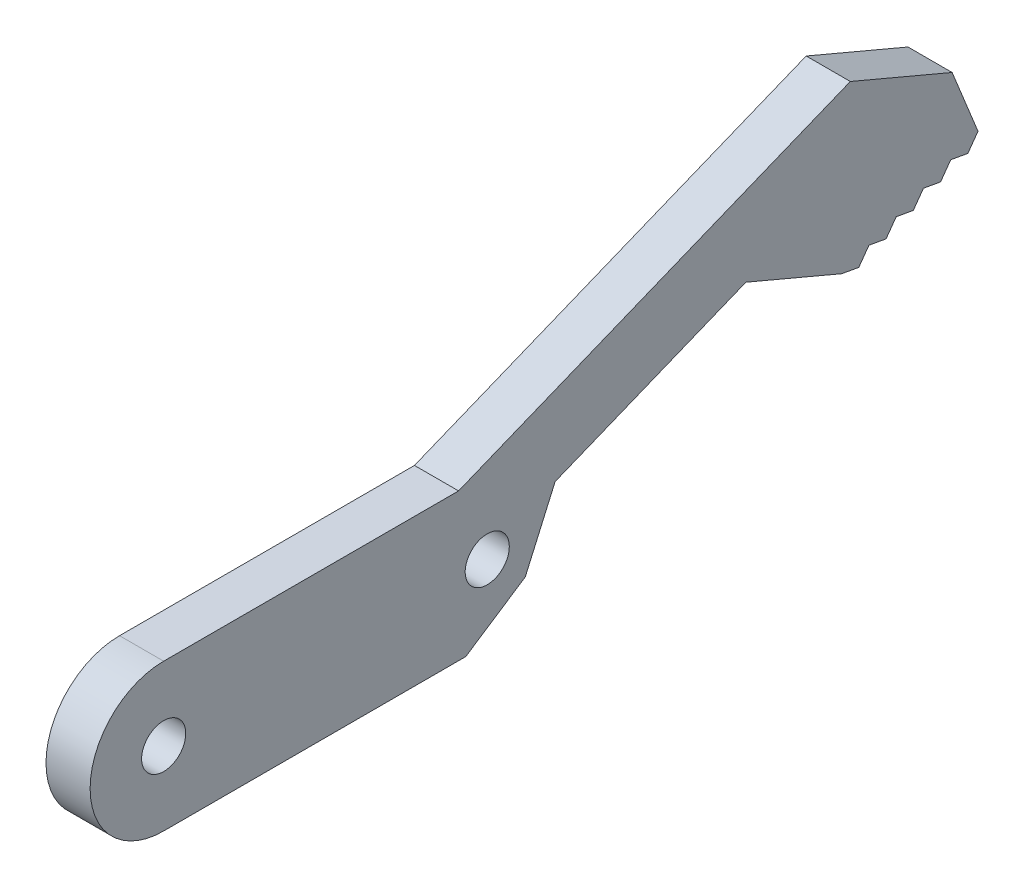
ISO-10303-21;
HEADER;
FILE_DESCRIPTION(('STEP AP214'),'2;1');
FILE_NAME('part.step','',(''),(''),'','','');
FILE_SCHEMA(('AUTOMOTIVE_DESIGN { 1 0 10303 214 1 1 1 1 }'));
ENDSEC;
DATA;
#1=APPLICATION_CONTEXT('core data for automotive mechanical design processes');
#2=APPLICATION_PROTOCOL_DEFINITION('international standard','automotive_design',2000,#1);
#3=PRODUCT_CONTEXT('',#1,'mechanical');
#4=PRODUCT('Part','Part','',(#3));
#5=PRODUCT_RELATED_PRODUCT_CATEGORY('part','',(#4));
#6=PRODUCT_DEFINITION_FORMATION('','',#4);
#7=PRODUCT_DEFINITION_CONTEXT('part definition',#1,'design');
#8=PRODUCT_DEFINITION('design','',#6,#7);
#9=PRODUCT_DEFINITION_SHAPE('','',#8);
#10=(LENGTH_UNIT() NAMED_UNIT(*) SI_UNIT(.MILLI.,.METRE.));
#11=(NAMED_UNIT(*) PLANE_ANGLE_UNIT() SI_UNIT($,.RADIAN.));
#12=(NAMED_UNIT(*) SI_UNIT($,.STERADIAN.) SOLID_ANGLE_UNIT());
#13=UNCERTAINTY_MEASURE_WITH_UNIT(LENGTH_MEASURE(1.E-05),#10,'distance_accuracy_value','');
#14=(GEOMETRIC_REPRESENTATION_CONTEXT(3) GLOBAL_UNCERTAINTY_ASSIGNED_CONTEXT((#13)) GLOBAL_UNIT_ASSIGNED_CONTEXT((#10,
#11,#12)) REPRESENTATION_CONTEXT('',''));
#15=CARTESIAN_POINT('',(0.,0.,0.));
#16=DIRECTION('',(0.,0.,1.));
#17=DIRECTION('',(1.,0.,0.));
#18=AXIS2_PLACEMENT_3D('',#15,#16,#17);
#19=CARTESIAN_POINT('',(3.,0.,0.));
#20=DIRECTION('',(1.,0.,0.));
#21=DIRECTION('',(0.,0.,-1.));
#22=AXIS2_PLACEMENT_3D('',#19,#20,#21);
#23=PLANE('',#22);
#24=CARTESIAN_POINT('',(3.,5.,-5.));
#25=DIRECTION('',(1.,0.,0.));
#26=DIRECTION('',(0.,0.,-1.));
#27=AXIS2_PLACEMENT_3D('',#24,#25,#26);
#28=CIRCLE('',#27,1.5);
#29=CARTESIAN_POINT('',(3.,5.,-6.5));
#30=VERTEX_POINT('',#29);
#31=EDGE_CURVE('E135',#30,#30,#28,.T.);
#32=ORIENTED_EDGE('',*,*,#31,.F.);
#33=EDGE_LOOP('',(#32));
#34=FACE_BOUND('',#33,.T.);
#35=CARTESIAN_POINT('',(3.,5.,-27.));
#36=DIRECTION('',(1.,0.,0.));
#37=DIRECTION('',(0.,0.,-1.));
#38=AXIS2_PLACEMENT_3D('',#35,#36,#37);
#39=CIRCLE('',#38,1.5);
#40=CARTESIAN_POINT('',(3.,5.,-28.5));
#41=VERTEX_POINT('',#40);
#42=EDGE_CURVE('E107',#41,#41,#39,.T.);
#43=ORIENTED_EDGE('',*,*,#42,.F.);
#44=EDGE_LOOP('',(#43));
#45=FACE_BOUND('',#44,.T.);
#46=DIRECTION('',(0.,-0.176310458660287,-0.984334608843456));
#47=VECTOR('',#46,1.);
#48=CARTESIAN_POINT('',(3.,22.5251811729283,-4.03462906650338));
#49=LINE('',#48,#47);
#50=CARTESIAN_POINT('',(3.,12.7674293983212,-58.5117874224691));
#51=VERTEX_POINT('',#50);
#52=CARTESIAN_POINT('',(3.,12.5590471430907,-59.6751776560989));
#53=VERTEX_POINT('',#52);
#54=EDGE_CURVE('E318',#51,#53,#49,.T.);
#55=ORIENTED_EDGE('',*,*,#54,.T.);
#56=DIRECTION('',(0.,0.811746559900308,-0.58400986506224));
#57=VECTOR('',#56,1.);
#58=CARTESIAN_POINT('',(3.,-24.0066089622226,-33.3680703114137));
#59=LINE('',#58,#57);
#60=CARTESIAN_POINT('',(3.,13.518454657046,-60.365421976732));
#61=VERTEX_POINT('',#60);
#62=EDGE_CURVE('E325',#53,#61,#59,.T.);
#63=ORIENTED_EDGE('',*,*,#62,.T.);
#64=DIRECTION('',(0.,0.926817277131444,0.37551262936239));
#65=VECTOR('',#64,1.);
#66=CARTESIAN_POINT('',(3.,22.9153076592473,-56.5581591368443));
#67=LINE('',#66,#65);
#68=CARTESIAN_POINT('',(3.,17.8605936004067,-58.6061453081692));
#69=VERTEX_POINT('',#68);
#70=EDGE_CURVE('E68',#61,#69,#67,.T.);
#71=ORIENTED_EDGE('',*,*,#70,.T.);
#72=DIRECTION('',(0.,-0.389831254937164,-0.920886308223831));
#73=VECTOR('',#72,1.);
#74=CARTESIAN_POINT('',(3.,36.1853832829632,-15.318061795041));
#75=LINE('',#74,#73);
#76=CARTESIAN_POINT('',(3.,20.7907778032993,-51.6842618551546));
#77=VERTEX_POINT('',#76);
#78=EDGE_CURVE('E223',#77,#69,#75,.T.);
#79=ORIENTED_EDGE('',*,*,#78,.F.);
#80=DIRECTION('',(0.,-0.375512629362391,0.926817277131444));
#81=VECTOR('',#80,1.);
#82=CARTESIAN_POINT('',(3.,-0.128680230886938,-0.0521365462638659));
#83=LINE('',#82,#81);
#84=CARTESIAN_POINT('',(3.,10.,-25.0511248584953));
#85=VERTEX_POINT('',#84);
#86=EDGE_CURVE('E191',#77,#85,#83,.T.);
#87=ORIENTED_EDGE('',*,*,#86,.T.);
#88=DIRECTION('',(0.,0.,-1.));
#89=VECTOR('',#88,1.);
#90=CARTESIAN_POINT('',(3.,10.,0.));
#91=LINE('',#90,#89);
#92=CARTESIAN_POINT('',(3.,10.,-5.));
#93=VERTEX_POINT('',#92);
#94=EDGE_CURVE('E121',#93,#85,#91,.T.);
#95=ORIENTED_EDGE('',*,*,#94,.F.);
#96=CARTESIAN_POINT('',(3.,5.,-5.));
#97=DIRECTION('',(1.,0.,0.));
#98=DIRECTION('',(0.,0.,-1.));
#99=AXIS2_PLACEMENT_3D('',#96,#97,#98);
#100=CIRCLE('',#99,5.);
#101=CARTESIAN_POINT('',(3.,0.,-5.));
#102=VERTEX_POINT('',#101);
#103=EDGE_CURVE('E76',#93,#102,#100,.T.);
#104=ORIENTED_EDGE('',*,*,#103,.T.);
#105=DIRECTION('',(0.,0.,-1.));
#106=VECTOR('',#105,1.);
#107=CARTESIAN_POINT('',(3.,0.,0.));
#108=LINE('',#107,#106);
#109=CARTESIAN_POINT('',(3.,0.,-25.5395987187029));
#110=VERTEX_POINT('',#109);
#111=EDGE_CURVE('E106',#102,#110,#108,.T.);
#112=ORIENTED_EDGE('',*,*,#111,.T.);
#113=DIRECTION('',(0.,-0.550241948439268,0.835005268353295));
#114=VECTOR('',#113,1.);
#115=CARTESIAN_POINT('',(3.,-11.7342944346662,-7.73252730012587));
#116=LINE('',#115,#114);
#117=CARTESIAN_POINT('',(3.,2.6649868288759,-29.5837797349184));
#118=VERTEX_POINT('',#117);
#119=EDGE_CURVE('E233',#118,#110,#116,.T.);
#120=ORIENTED_EDGE('',*,*,#119,.F.);
#121=DIRECTION('',(0.,-0.914844215196766,0.403806961209207));
#122=VECTOR('',#121,1.);
#123=CARTESIAN_POINT('',(3.,-10.4943006753816,-23.7753461125561));
#124=LINE('',#123,#122);
#125=CARTESIAN_POINT('',(3.,7.0958518163384,-31.5395379901429));
#126=VERTEX_POINT('',#125);
#127=EDGE_CURVE('E237',#126,#118,#124,.T.);
#128=ORIENTED_EDGE('',*,*,#127,.F.);
#129=DIRECTION('',(0.,-0.920886308223829,0.389831254937168));
#130=VECTOR('',#129,1.);
#131=CARTESIAN_POINT('',(3.,-10.2440418078816,-24.1991829086949));
#132=LINE('',#131,#130);
#133=CARTESIAN_POINT('',(3.,7.26267479119386,-31.6101577931083));
#134=VERTEX_POINT('',#133);
#135=EDGE_CURVE('E155',#134,#126,#132,.T.);
#136=ORIENTED_EDGE('',*,*,#135,.F.);
#137=DIRECTION('',(0.,0.375512629362391,-0.926817277131444));
#138=VECTOR('',#137,1.);
#139=CARTESIAN_POINT('',(3.,-4.76276661654416,-1.92969969307582));
#140=LINE('',#139,#138);
#141=CARTESIAN_POINT('',(3.,12.5198516022673,-44.5855996729485));
#142=VERTEX_POINT('',#141);
#143=EDGE_CURVE('E185',#134,#142,#140,.T.);
#144=ORIENTED_EDGE('',*,*,#143,.T.);
#145=DIRECTION('',(0.,-0.389831254937164,-0.920886308223831));
#146=VECTOR('',#145,1.);
#147=CARTESIAN_POINT('',(3.,26.6230259445322,-11.2701074187967));
#148=LINE('',#147,#146);
#149=CARTESIAN_POINT('',(3.,9.76332836342207,-51.0972492054176));
#150=VERTEX_POINT('',#149);
#151=EDGE_CURVE('E188',#142,#150,#148,.T.);
#152=ORIENTED_EDGE('',*,*,#151,.T.);
#153=DIRECTION('',(0.,-0.176310458660284,-0.984334608843456));
#154=VECTOR('',#153,1.);
#155=CARTESIAN_POINT('',(3.,18.3276818691169,-3.28278815708864));
#156=LINE('',#155,#154);
#157=CARTESIAN_POINT('',(3.,9.55494610819164,-52.2606394390473));
#158=VERTEX_POINT('',#157);
#159=EDGE_CURVE('E246',#150,#158,#156,.T.);
#160=ORIENTED_EDGE('',*,*,#159,.T.);
#161=DIRECTION('',(0.,0.811746559900306,-0.584009865062243));
#162=VECTOR('',#161,1.);
#163=CARTESIAN_POINT('',(3.,-21.5162149640903,-29.9065384406037));
#164=LINE('',#163,#162);
#165=CARTESIAN_POINT('',(3.,10.5143536221468,-52.9508837596805));
#166=VERTEX_POINT('',#165);
#167=EDGE_CURVE('E259',#158,#166,#164,.T.);
#168=ORIENTED_EDGE('',*,*,#167,.T.);
#169=DIRECTION('',(0.,-0.176310458660286,-0.984334608843456));
#170=VECTOR('',#169,1.);
#171=CARTESIAN_POINT('',(3.,19.3770566950698,-3.47074838444234));
#172=LINE('',#171,#170);
#173=CARTESIAN_POINT('',(3.,10.3059713669164,-54.1142739933102));
#174=VERTEX_POINT('',#173);
#175=EDGE_CURVE('E264',#166,#174,#172,.T.);
#176=ORIENTED_EDGE('',*,*,#175,.T.);
#177=DIRECTION('',(0.,0.811746559900306,-0.584009865062243));
#178=VECTOR('',#177,1.);
#179=CARTESIAN_POINT('',(3.,-22.1388134636234,-30.7719214083061));
#180=LINE('',#179,#178);
#181=CARTESIAN_POINT('',(3.,11.2653788808716,-54.8045183139434));
#182=VERTEX_POINT('',#181);
#183=EDGE_CURVE('E277',#174,#182,#180,.T.);
#184=ORIENTED_EDGE('',*,*,#183,.T.);
#185=DIRECTION('',(0.,-0.176310458660287,-0.984334608843456));
#186=VECTOR('',#185,1.);
#187=CARTESIAN_POINT('',(3.,20.4264315210226,-3.65870861179605));
#188=LINE('',#187,#186);
#189=CARTESIAN_POINT('',(3.,11.0569966256412,-55.9679085475731));
#190=VERTEX_POINT('',#189);
#191=EDGE_CURVE('E282',#182,#190,#188,.T.);
#192=ORIENTED_EDGE('',*,*,#191,.T.);
#193=DIRECTION('',(0.,0.811746559900306,-0.584009865062243));
#194=VECTOR('',#193,1.);
#195=CARTESIAN_POINT('',(3.,-22.7614119631564,-31.6373043760086));
#196=LINE('',#195,#194);
#197=CARTESIAN_POINT('',(3.,12.0164041395964,-56.6581528682063));
#198=VERTEX_POINT('',#197);
#199=EDGE_CURVE('E295',#190,#198,#196,.T.);
#200=ORIENTED_EDGE('',*,*,#199,.T.);
#201=DIRECTION('',(0.,-0.176310458660287,-0.984334608843456));
#202=VECTOR('',#201,1.);
#203=CARTESIAN_POINT('',(3.,21.4758063469754,-3.84666883914971));
#204=LINE('',#203,#202);
#205=CARTESIAN_POINT('',(3.,11.808021884366,-57.821543101836));
#206=VERTEX_POINT('',#205);
#207=EDGE_CURVE('E300',#198,#206,#204,.T.);
#208=ORIENTED_EDGE('',*,*,#207,.T.);
#209=DIRECTION('',(0.,0.811746559900303,-0.584009865062247));
#210=VECTOR('',#209,1.);
#211=CARTESIAN_POINT('',(3.,-23.3840104626895,-32.5026873437108));
#212=LINE('',#211,#210);
#213=EDGE_CURVE('E313',#206,#51,#212,.T.);
#214=ORIENTED_EDGE('',*,*,#213,.T.);
#215=EDGE_LOOP('',(#55,#63,#71,#79,#87,#95,#104,#112,#120,#128,#136,#144,#152,#160,#168,#176,
#184,#192,#200,#208,#214));
#216=FACE_BOUND('',#215,.T.);
#217=ADVANCED_FACE('F53',(#34,#45,#216),#23,.T.);
#218=CARTESIAN_POINT('',(0.,0.,0.));
#219=DIRECTION('',(1.,0.,0.));
#220=DIRECTION('',(0.,0.,-1.));
#221=AXIS2_PLACEMENT_3D('',#218,#219,#220);
#222=PLANE('',#221);
#223=CARTESIAN_POINT('',(0.,5.,-5.));
#224=DIRECTION('',(1.,0.,0.));
#225=DIRECTION('',(0.,0.,-1.));
#226=AXIS2_PLACEMENT_3D('',#223,#224,#225);
#227=CIRCLE('',#226,1.5);
#228=CARTESIAN_POINT('',(0.,5.,-6.5));
#229=VERTEX_POINT('',#228);
#230=EDGE_CURVE('E113',#229,#229,#227,.T.);
#231=ORIENTED_EDGE('',*,*,#230,.T.);
#232=EDGE_LOOP('',(#231));
#233=FACE_BOUND('',#232,.T.);
#234=CARTESIAN_POINT('',(0.,5.,-27.));
#235=DIRECTION('',(1.,0.,0.));
#236=DIRECTION('',(0.,0.,-1.));
#237=AXIS2_PLACEMENT_3D('',#234,#235,#236);
#238=CIRCLE('',#237,1.5);
#239=CARTESIAN_POINT('',(0.,5.,-28.5));
#240=VERTEX_POINT('',#239);
#241=EDGE_CURVE('E116',#240,#240,#238,.T.);
#242=ORIENTED_EDGE('',*,*,#241,.T.);
#243=EDGE_LOOP('',(#242));
#244=FACE_BOUND('',#243,.T.);
#245=DIRECTION('',(0.,0.811746559900308,-0.58400986506224));
#246=VECTOR('',#245,1.);
#247=CARTESIAN_POINT('',(0.,-24.0066089622226,-33.3680703114137));
#248=LINE('',#247,#246);
#249=CARTESIAN_POINT('',(0.,12.5590471430907,-59.6751776560989));
#250=VERTEX_POINT('',#249);
#251=CARTESIAN_POINT('',(0.,13.518454657046,-60.365421976732));
#252=VERTEX_POINT('',#251);
#253=EDGE_CURVE('E321',#250,#252,#248,.T.);
#254=ORIENTED_EDGE('',*,*,#253,.F.);
#255=DIRECTION('',(0.,-0.176310458660287,-0.984334608843456));
#256=VECTOR('',#255,1.);
#257=CARTESIAN_POINT('',(0.,22.5251811729283,-4.03462906650338));
#258=LINE('',#257,#256);
#259=CARTESIAN_POINT('',(0.,12.7674293983212,-58.5117874224691));
#260=VERTEX_POINT('',#259);
#261=EDGE_CURVE('E303',#260,#250,#258,.T.);
#262=ORIENTED_EDGE('',*,*,#261,.F.);
#263=DIRECTION('',(0.,0.811746559900303,-0.584009865062247));
#264=VECTOR('',#263,1.);
#265=CARTESIAN_POINT('',(0.,-23.3840104626895,-32.5026873437108));
#266=LINE('',#265,#264);
#267=CARTESIAN_POINT('',(0.,11.808021884366,-57.821543101836));
#268=VERTEX_POINT('',#267);
#269=EDGE_CURVE('E306',#268,#260,#266,.T.);
#270=ORIENTED_EDGE('',*,*,#269,.F.);
#271=DIRECTION('',(0.,-0.176310458660287,-0.984334608843456));
#272=VECTOR('',#271,1.);
#273=CARTESIAN_POINT('',(0.,21.4758063469754,-3.84666883914971));
#274=LINE('',#273,#272);
#275=CARTESIAN_POINT('',(0.,12.0164041395964,-56.6581528682063));
#276=VERTEX_POINT('',#275);
#277=EDGE_CURVE('E285',#276,#268,#274,.T.);
#278=ORIENTED_EDGE('',*,*,#277,.F.);
#279=DIRECTION('',(0.,0.811746559900306,-0.584009865062243));
#280=VECTOR('',#279,1.);
#281=CARTESIAN_POINT('',(0.,-22.7614119631564,-31.6373043760086));
#282=LINE('',#281,#280);
#283=CARTESIAN_POINT('',(0.,11.0569966256412,-55.9679085475731));
#284=VERTEX_POINT('',#283);
#285=EDGE_CURVE('E288',#284,#276,#282,.T.);
#286=ORIENTED_EDGE('',*,*,#285,.F.);
#287=DIRECTION('',(0.,-0.176310458660287,-0.984334608843456));
#288=VECTOR('',#287,1.);
#289=CARTESIAN_POINT('',(0.,20.4264315210226,-3.65870861179605));
#290=LINE('',#289,#288);
#291=CARTESIAN_POINT('',(0.,11.2653788808716,-54.8045183139434));
#292=VERTEX_POINT('',#291);
#293=EDGE_CURVE('E267',#292,#284,#290,.T.);
#294=ORIENTED_EDGE('',*,*,#293,.F.);
#295=DIRECTION('',(0.,0.811746559900306,-0.584009865062243));
#296=VECTOR('',#295,1.);
#297=CARTESIAN_POINT('',(0.,-22.1388134636234,-30.7719214083062));
#298=LINE('',#297,#296);
#299=CARTESIAN_POINT('',(0.,10.3059713669164,-54.1142739933102));
#300=VERTEX_POINT('',#299);
#301=EDGE_CURVE('E270',#300,#292,#298,.T.);
#302=ORIENTED_EDGE('',*,*,#301,.F.);
#303=DIRECTION('',(0.,-0.176310458660286,-0.984334608843456));
#304=VECTOR('',#303,1.);
#305=CARTESIAN_POINT('',(0.,19.3770566950698,-3.47074838444234));
#306=LINE('',#305,#304);
#307=CARTESIAN_POINT('',(0.,10.5143536221468,-52.9508837596805));
#308=VERTEX_POINT('',#307);
#309=EDGE_CURVE('E249',#308,#300,#306,.T.);
#310=ORIENTED_EDGE('',*,*,#309,.F.);
#311=DIRECTION('',(0.,0.811746559900306,-0.584009865062243));
#312=VECTOR('',#311,1.);
#313=CARTESIAN_POINT('',(0.,-21.5162149640903,-29.9065384406037));
#314=LINE('',#313,#312);
#315=CARTESIAN_POINT('',(0.,9.55494610819164,-52.2606394390473));
#316=VERTEX_POINT('',#315);
#317=EDGE_CURVE('E252',#316,#308,#314,.T.);
#318=ORIENTED_EDGE('',*,*,#317,.F.);
#319=DIRECTION('',(0.,-0.176310458660284,-0.984334608843456));
#320=VECTOR('',#319,1.);
#321=CARTESIAN_POINT('',(0.,18.3276818691169,-3.28278815708864));
#322=LINE('',#321,#320);
#323=CARTESIAN_POINT('',(0.,9.76332836342207,-51.0972492054176));
#324=VERTEX_POINT('',#323);
#325=EDGE_CURVE('E240',#324,#316,#322,.T.);
#326=ORIENTED_EDGE('',*,*,#325,.F.);
#327=DIRECTION('',(0.,-0.389831254937164,-0.920886308223831));
#328=VECTOR('',#327,1.);
#329=CARTESIAN_POINT('',(0.,26.6230259445322,-11.2701074187967));
#330=LINE('',#329,#328);
#331=CARTESIAN_POINT('',(0.,12.5198516022673,-44.5855996729485));
#332=VERTEX_POINT('',#331);
#333=EDGE_CURVE('E196',#332,#324,#330,.T.);
#334=ORIENTED_EDGE('',*,*,#333,.F.);
#335=DIRECTION('',(0.,0.375512629362391,-0.926817277131444));
#336=VECTOR('',#335,1.);
#337=CARTESIAN_POINT('',(0.,-4.76276661654416,-1.92969969307582));
#338=LINE('',#337,#336);
#339=CARTESIAN_POINT('',(0.,7.26267479119386,-31.6101577931083));
#340=VERTEX_POINT('',#339);
#341=EDGE_CURVE('E194',#340,#332,#338,.T.);
#342=ORIENTED_EDGE('',*,*,#341,.F.);
#343=DIRECTION('',(0.,-0.920886308223829,0.389831254937168));
#344=VECTOR('',#343,1.);
#345=CARTESIAN_POINT('',(0.,-10.2440418078816,-24.1991829086949));
#346=LINE('',#345,#344);
#347=CARTESIAN_POINT('',(0.,7.0958518163384,-31.5395379901429));
#348=VERTEX_POINT('',#347);
#349=EDGE_CURVE('E168',#340,#348,#346,.T.);
#350=ORIENTED_EDGE('',*,*,#349,.T.);
#351=DIRECTION('',(0.,-0.914844215196766,0.403806961209207));
#352=VECTOR('',#351,1.);
#353=CARTESIAN_POINT('',(0.,-10.4943006753816,-23.7753461125561));
#354=LINE('',#353,#352);
#355=CARTESIAN_POINT('',(0.,2.6649868288759,-29.5837797349184));
#356=VERTEX_POINT('',#355);
#357=EDGE_CURVE('E225',#348,#356,#354,.T.);
#358=ORIENTED_EDGE('',*,*,#357,.T.);
#359=DIRECTION('',(0.,-0.550241948439268,0.835005268353295));
#360=VECTOR('',#359,1.);
#361=CARTESIAN_POINT('',(0.,-11.7342944346662,-7.73252730012587));
#362=LINE('',#361,#360);
#363=CARTESIAN_POINT('',(0.,0.,-25.5395987187029));
#364=VERTEX_POINT('',#363);
#365=EDGE_CURVE('E12',#356,#364,#362,.T.);
#366=ORIENTED_EDGE('',*,*,#365,.T.);
#367=DIRECTION('',(0.,0.,-1.));
#368=VECTOR('',#367,1.);
#369=CARTESIAN_POINT('',(0.,0.,0.));
#370=LINE('',#369,#368);
#371=CARTESIAN_POINT('',(0.,0.,-5.));
#372=VERTEX_POINT('',#371);
#373=EDGE_CURVE('E98',#372,#364,#370,.T.);
#374=ORIENTED_EDGE('',*,*,#373,.F.);
#375=CARTESIAN_POINT('',(0.,5.,-5.));
#376=DIRECTION('',(1.,0.,0.));
#377=DIRECTION('',(0.,0.,-1.));
#378=AXIS2_PLACEMENT_3D('',#375,#376,#377);
#379=CIRCLE('',#378,5.);
#380=CARTESIAN_POINT('',(0.,10.,-5.));
#381=VERTEX_POINT('',#380);
#382=EDGE_CURVE('E89',#381,#372,#379,.T.);
#383=ORIENTED_EDGE('',*,*,#382,.F.);
#384=DIRECTION('',(0.,0.,-1.));
#385=VECTOR('',#384,1.);
#386=CARTESIAN_POINT('',(0.,10.,0.));
#387=LINE('',#386,#385);
#388=CARTESIAN_POINT('',(0.,10.,-25.0511248584953));
#389=VERTEX_POINT('',#388);
#390=EDGE_CURVE('E99',#381,#389,#387,.T.);
#391=ORIENTED_EDGE('',*,*,#390,.T.);
#392=DIRECTION('',(0.,-0.375512629362391,0.926817277131444));
#393=VECTOR('',#392,1.);
#394=CARTESIAN_POINT('',(0.,-0.128680230886938,-0.0521365462638659));
#395=LINE('',#394,#393);
#396=CARTESIAN_POINT('',(0.,20.7907778032993,-51.6842618551546));
#397=VERTEX_POINT('',#396);
#398=EDGE_CURVE('E175',#397,#389,#395,.T.);
#399=ORIENTED_EDGE('',*,*,#398,.F.);
#400=DIRECTION('',(0.,-0.389831254937164,-0.920886308223831));
#401=VECTOR('',#400,1.);
#402=CARTESIAN_POINT('',(0.,36.1853832829632,-15.318061795041));
#403=LINE('',#402,#401);
#404=CARTESIAN_POINT('',(0.,17.8605936004068,-58.6061453081692));
#405=VERTEX_POINT('',#404);
#406=EDGE_CURVE('E221',#397,#405,#403,.T.);
#407=ORIENTED_EDGE('',*,*,#406,.T.);
#408=DIRECTION('',(0.,0.926817277131444,0.37551262936239));
#409=VECTOR('',#408,1.);
#410=CARTESIAN_POINT('',(0.,22.9153076592473,-56.5581591368443));
#411=LINE('',#410,#409);
#412=EDGE_CURVE('E181',#252,#405,#411,.T.);
#413=ORIENTED_EDGE('',*,*,#412,.F.);
#414=EDGE_LOOP('',(#254,#262,#270,#278,#286,#294,#302,#310,#318,#326,#334,#342,#350,#358,#366,
#374,#383,#391,#399,#407,#413));
#415=FACE_BOUND('',#414,.T.);
#416=ADVANCED_FACE('F110',(#233,#244,#415),#222,.F.);
#417=CARTESIAN_POINT('',(0.,22.9153076592473,-56.5581591368443));
#418=DIRECTION('',(0.,0.37551262936239,-0.926817277131444));
#419=DIRECTION('',(0.,0.926817277131444,0.37551262936239));
#420=AXIS2_PLACEMENT_3D('',#417,#418,#419);
#421=PLANE('',#420);
#422=ORIENTED_EDGE('',*,*,#70,.F.);
#423=DIRECTION('',(1.,0.,0.));
#424=VECTOR('',#423,1.);
#425=CARTESIAN_POINT('',(-7.,13.518454657046,-60.365421976732));
#426=LINE('',#425,#424);
#427=EDGE_CURVE('E213',#252,#61,#426,.T.);
#428=ORIENTED_EDGE('',*,*,#427,.F.);
#429=ORIENTED_EDGE('',*,*,#412,.T.);
#430=DIRECTION('',(1.,0.,0.));
#431=VECTOR('',#430,1.);
#432=CARTESIAN_POINT('',(0.,17.8605936004068,-58.6061453081692));
#433=LINE('',#432,#431);
#434=EDGE_CURVE('E189',#405,#69,#433,.T.);
#435=ORIENTED_EDGE('',*,*,#434,.T.);
#436=EDGE_LOOP('',(#422,#428,#429,#435));
#437=FACE_BOUND('',#436,.T.);
#438=ADVANCED_FACE('F210',(#437),#421,.T.);
#439=CARTESIAN_POINT('',(3.,10.,0.));
#440=DIRECTION('',(0.,1.,0.));
#441=DIRECTION('',(0.,0.,1.));
#442=AXIS2_PLACEMENT_3D('',#439,#440,#441);
#443=PLANE('',#442);
#444=DIRECTION('',(1.,0.,0.));
#445=VECTOR('',#444,1.);
#446=CARTESIAN_POINT('',(0.,10.,-25.0511248584953));
#447=LINE('',#446,#445);
#448=EDGE_CURVE('E152',#389,#85,#447,.T.);
#449=ORIENTED_EDGE('',*,*,#448,.F.);
#450=ORIENTED_EDGE('',*,*,#390,.F.);
#451=DIRECTION('',(-1.,0.,0.));
#452=VECTOR('',#451,1.);
#453=CARTESIAN_POINT('',(3.,10.,-5.));
#454=LINE('',#453,#452);
#455=EDGE_CURVE('E61',#93,#381,#454,.T.);
#456=ORIENTED_EDGE('',*,*,#455,.F.);
#457=ORIENTED_EDGE('',*,*,#94,.T.);
#458=EDGE_LOOP('',(#449,#450,#456,#457));
#459=FACE_BOUND('',#458,.T.);
#460=ADVANCED_FACE('F55',(#459),#443,.T.);
#461=CARTESIAN_POINT('',(3.,5.,-5.));
#462=DIRECTION('',(-1.,0.,0.));
#463=DIRECTION('',(0.,0.,1.));
#464=AXIS2_PLACEMENT_3D('',#461,#462,#463);
#465=CYLINDRICAL_SURFACE('',#464,5.);
#466=ORIENTED_EDGE('',*,*,#382,.T.);
#467=DIRECTION('',(-1.,0.,0.));
#468=VECTOR('',#467,1.);
#469=CARTESIAN_POINT('',(3.,0.,-5.));
#470=LINE('',#469,#468);
#471=EDGE_CURVE('E92',#102,#372,#470,.T.);
#472=ORIENTED_EDGE('',*,*,#471,.F.);
#473=ORIENTED_EDGE('',*,*,#103,.F.);
#474=ORIENTED_EDGE('',*,*,#455,.T.);
#475=EDGE_LOOP('',(#466,#472,#473,#474));
#476=FACE_BOUND('',#475,.T.);
#477=ADVANCED_FACE('F91',(#476),#465,.T.);
#478=CARTESIAN_POINT('',(3.,0.,0.));
#479=DIRECTION('',(0.,1.,0.));
#480=DIRECTION('',(0.,0.,1.));
#481=AXIS2_PLACEMENT_3D('',#478,#479,#480);
#482=PLANE('',#481);
#483=ORIENTED_EDGE('',*,*,#373,.T.);
#484=DIRECTION('',(1.,0.,0.));
#485=VECTOR('',#484,1.);
#486=CARTESIAN_POINT('',(-7.,0.,-25.5395987187029));
#487=LINE('',#486,#485);
#488=EDGE_CURVE('E229',#364,#110,#487,.T.);
#489=ORIENTED_EDGE('',*,*,#488,.T.);
#490=ORIENTED_EDGE('',*,*,#111,.F.);
#491=ORIENTED_EDGE('',*,*,#471,.T.);
#492=EDGE_LOOP('',(#483,#489,#490,#491));
#493=FACE_BOUND('',#492,.T.);
#494=ADVANCED_FACE('F103',(#493),#482,.F.);
#495=CARTESIAN_POINT('',(3.,5.,-5.));
#496=DIRECTION('',(-1.,0.,0.));
#497=DIRECTION('',(0.,0.,1.));
#498=AXIS2_PLACEMENT_3D('',#495,#496,#497);
#499=CYLINDRICAL_SURFACE('',#498,1.5);
#500=ORIENTED_EDGE('',*,*,#31,.T.);
#501=EDGE_LOOP('',(#500));
#502=FACE_BOUND('',#501,.T.);
#503=ORIENTED_EDGE('',*,*,#230,.F.);
#504=EDGE_LOOP('',(#503));
#505=FACE_BOUND('',#504,.T.);
#506=ADVANCED_FACE('F461',(#502,#505),#499,.F.);
#507=CARTESIAN_POINT('',(3.,5.,-27.));
#508=DIRECTION('',(-1.,0.,0.));
#509=DIRECTION('',(0.,0.,1.));
#510=AXIS2_PLACEMENT_3D('',#507,#508,#509);
#511=CYLINDRICAL_SURFACE('',#510,1.5);
#512=ORIENTED_EDGE('',*,*,#42,.T.);
#513=EDGE_LOOP('',(#512));
#514=FACE_BOUND('',#513,.T.);
#515=ORIENTED_EDGE('',*,*,#241,.F.);
#516=EDGE_LOOP('',(#515));
#517=FACE_BOUND('',#516,.T.);
#518=ADVANCED_FACE('F458',(#514,#517),#511,.F.);
#519=CARTESIAN_POINT('',(0.,-4.76276661654416,-1.92969969307582));
#520=DIRECTION('',(0.,-0.926817277131444,-0.375512629362391));
#521=DIRECTION('',(0.,0.375512629362391,-0.926817277131444));
#522=AXIS2_PLACEMENT_3D('',#519,#520,#521);
#523=PLANE('',#522);
#524=ORIENTED_EDGE('',*,*,#143,.F.);
#525=DIRECTION('',(1.,0.,0.));
#526=VECTOR('',#525,1.);
#527=CARTESIAN_POINT('',(0.,7.26267479119386,-31.6101577931083));
#528=LINE('',#527,#526);
#529=EDGE_CURVE('E139',#340,#134,#528,.T.);
#530=ORIENTED_EDGE('',*,*,#529,.F.);
#531=ORIENTED_EDGE('',*,*,#341,.T.);
#532=DIRECTION('',(1.,0.,0.));
#533=VECTOR('',#532,1.);
#534=CARTESIAN_POINT('',(0.,12.5198516022673,-44.5855996729485));
#535=LINE('',#534,#533);
#536=EDGE_CURVE('E131',#332,#142,#535,.T.);
#537=ORIENTED_EDGE('',*,*,#536,.T.);
#538=EDGE_LOOP('',(#524,#530,#531,#537));
#539=FACE_BOUND('',#538,.T.);
#540=ADVANCED_FACE('F455',(#539),#523,.T.);
#541=CARTESIAN_POINT('',(0.,-10.2440418078816,-24.1991829086949));
#542=DIRECTION('',(0.,0.389831254937168,0.920886308223829));
#543=DIRECTION('',(0.,-0.920886308223829,0.389831254937168));
#544=AXIS2_PLACEMENT_3D('',#541,#542,#543);
#545=PLANE('',#544);
#546=ORIENTED_EDGE('',*,*,#135,.T.);
#547=DIRECTION('',(1.,0.,0.));
#548=VECTOR('',#547,1.);
#549=CARTESIAN_POINT('',(0.,7.0958518163384,-31.5395379901429));
#550=LINE('',#549,#548);
#551=EDGE_CURVE('E143',#348,#126,#550,.T.);
#552=ORIENTED_EDGE('',*,*,#551,.F.);
#553=ORIENTED_EDGE('',*,*,#349,.F.);
#554=ORIENTED_EDGE('',*,*,#529,.T.);
#555=EDGE_LOOP('',(#546,#552,#553,#554));
#556=FACE_BOUND('',#555,.T.);
#557=ADVANCED_FACE('F478',(#556),#545,.F.);
#558=CARTESIAN_POINT('',(0.,-0.128680230886938,-0.0521365462638659));
#559=DIRECTION('',(0.,0.926817277131444,0.375512629362391));
#560=DIRECTION('',(0.,-0.375512629362391,0.926817277131444));
#561=AXIS2_PLACEMENT_3D('',#558,#559,#560);
#562=PLANE('',#561);
#563=DIRECTION('',(1.,0.,0.));
#564=VECTOR('',#563,1.);
#565=CARTESIAN_POINT('',(0.,20.7907778032993,-51.6842618551546));
#566=LINE('',#565,#564);
#567=EDGE_CURVE('E201',#397,#77,#566,.T.);
#568=ORIENTED_EDGE('',*,*,#567,.F.);
#569=ORIENTED_EDGE('',*,*,#398,.T.);
#570=ORIENTED_EDGE('',*,*,#448,.T.);
#571=ORIENTED_EDGE('',*,*,#86,.F.);
#572=EDGE_LOOP('',(#568,#569,#570,#571));
#573=FACE_BOUND('',#572,.T.);
#574=ADVANCED_FACE('F476',(#573),#562,.T.);
#575=CARTESIAN_POINT('',(0.,26.6230259445322,-11.2701074187967));
#576=DIRECTION('',(0.,-0.920886308223831,0.389831254937164));
#577=DIRECTION('',(0.,-0.389831254937164,-0.920886308223831));
#578=AXIS2_PLACEMENT_3D('',#575,#576,#577);
#579=PLANE('',#578);
#580=ORIENTED_EDGE('',*,*,#151,.F.);
#581=ORIENTED_EDGE('',*,*,#536,.F.);
#582=ORIENTED_EDGE('',*,*,#333,.T.);
#583=DIRECTION('',(1.,0.,0.));
#584=VECTOR('',#583,1.);
#585=CARTESIAN_POINT('',(0.,9.76332836342207,-51.0972492054176));
#586=LINE('',#585,#584);
#587=EDGE_CURVE('E159',#324,#150,#586,.T.);
#588=ORIENTED_EDGE('',*,*,#587,.T.);
#589=EDGE_LOOP('',(#580,#581,#582,#588));
#590=FACE_BOUND('',#589,.T.);
#591=ADVANCED_FACE('F410',(#590),#579,.T.);
#592=CARTESIAN_POINT('',(0.,36.1853832829632,-15.318061795041));
#593=DIRECTION('',(0.,-0.920886308223831,0.389831254937164));
#594=DIRECTION('',(0.,-0.389831254937164,-0.920886308223831));
#595=AXIS2_PLACEMENT_3D('',#592,#593,#594);
#596=PLANE('',#595);
#597=ORIENTED_EDGE('',*,*,#78,.T.);
#598=ORIENTED_EDGE('',*,*,#434,.F.);
#599=ORIENTED_EDGE('',*,*,#406,.F.);
#600=ORIENTED_EDGE('',*,*,#567,.T.);
#601=EDGE_LOOP('',(#597,#598,#599,#600));
#602=FACE_BOUND('',#601,.T.);
#603=ADVANCED_FACE('F219',(#602),#596,.F.);
#604=CARTESIAN_POINT('',(-7.,-11.7342944346662,-7.73252730012587));
#605=DIRECTION('',(0.,0.835005268353295,0.550241948439268));
#606=DIRECTION('',(0.,-0.550241948439268,0.835005268353295));
#607=AXIS2_PLACEMENT_3D('',#604,#605,#606);
#608=PLANE('',#607);
#609=DIRECTION('',(1.,0.,0.));
#610=VECTOR('',#609,1.);
#611=CARTESIAN_POINT('',(-7.,2.6649868288759,-29.5837797349184));
#612=LINE('',#611,#610);
#613=EDGE_CURVE('E230',#356,#118,#612,.T.);
#614=ORIENTED_EDGE('',*,*,#613,.T.);
#615=ORIENTED_EDGE('',*,*,#119,.T.);
#616=ORIENTED_EDGE('',*,*,#488,.F.);
#617=ORIENTED_EDGE('',*,*,#365,.F.);
#618=EDGE_LOOP('',(#614,#615,#616,#617));
#619=FACE_BOUND('',#618,.T.);
#620=ADVANCED_FACE('F488',(#619),#608,.F.);
#621=CARTESIAN_POINT('',(-7.,-10.4943006753816,-23.7753461125561));
#622=DIRECTION('',(0.,0.403806961209207,0.914844215196766));
#623=DIRECTION('',(0.,-0.914844215196766,0.403806961209207));
#624=AXIS2_PLACEMENT_3D('',#621,#622,#623);
#625=PLANE('',#624);
#626=ORIENTED_EDGE('',*,*,#551,.T.);
#627=ORIENTED_EDGE('',*,*,#127,.T.);
#628=ORIENTED_EDGE('',*,*,#613,.F.);
#629=ORIENTED_EDGE('',*,*,#357,.F.);
#630=EDGE_LOOP('',(#626,#627,#628,#629));
#631=FACE_BOUND('',#630,.T.);
#632=ADVANCED_FACE('F489',(#631),#625,.F.);
#633=CARTESIAN_POINT('',(-7.,18.3276818691169,-3.28278815708864));
#634=DIRECTION('',(0.,-0.984334608843456,0.176310458660284));
#635=DIRECTION('',(0.,-0.176310458660284,-0.984334608843456));
#636=AXIS2_PLACEMENT_3D('',#633,#634,#635);
#637=PLANE('',#636);
#638=ORIENTED_EDGE('',*,*,#325,.T.);
#639=DIRECTION('',(1.,0.,0.));
#640=VECTOR('',#639,1.);
#641=CARTESIAN_POINT('',(-7.,9.55494610819164,-52.2606394390473));
#642=LINE('',#641,#640);
#643=EDGE_CURVE('E243',#316,#158,#642,.T.);
#644=ORIENTED_EDGE('',*,*,#643,.T.);
#645=ORIENTED_EDGE('',*,*,#159,.F.);
#646=ORIENTED_EDGE('',*,*,#587,.F.);
#647=EDGE_LOOP('',(#638,#644,#645,#646));
#648=FACE_BOUND('',#647,.T.);
#649=ADVANCED_FACE('F408',(#648),#637,.T.);
#650=CARTESIAN_POINT('',(-7.,19.3770566950698,-3.47074838444234));
#651=DIRECTION('',(0.,-0.984334608843456,0.176310458660286));
#652=DIRECTION('',(0.,-0.176310458660286,-0.984334608843456));
#653=AXIS2_PLACEMENT_3D('',#650,#651,#652);
#654=PLANE('',#653);
#655=ORIENTED_EDGE('',*,*,#309,.T.);
#656=DIRECTION('',(1.,0.,0.));
#657=VECTOR('',#656,1.);
#658=CARTESIAN_POINT('',(-7.,10.3059713669164,-54.1142739933102));
#659=LINE('',#658,#657);
#660=EDGE_CURVE('E255',#300,#174,#659,.T.);
#661=ORIENTED_EDGE('',*,*,#660,.T.);
#662=ORIENTED_EDGE('',*,*,#175,.F.);
#663=DIRECTION('',(1.,0.,0.));
#664=VECTOR('',#663,1.);
#665=CARTESIAN_POINT('',(-7.,10.5143536221468,-52.9508837596805));
#666=LINE('',#665,#664);
#667=EDGE_CURVE('E256',#308,#166,#666,.T.);
#668=ORIENTED_EDGE('',*,*,#667,.F.);
#669=EDGE_LOOP('',(#655,#661,#662,#668));
#670=FACE_BOUND('',#669,.T.);
#671=ADVANCED_FACE('F420',(#670),#654,.T.);
#672=CARTESIAN_POINT('',(-7.,-21.5162149640903,-29.9065384406037));
#673=DIRECTION('',(0.,-0.584009865062243,-0.811746559900306));
#674=DIRECTION('',(0.,0.811746559900306,-0.584009865062243));
#675=AXIS2_PLACEMENT_3D('',#672,#673,#674);
#676=PLANE('',#675);
#677=ORIENTED_EDGE('',*,*,#317,.T.);
#678=ORIENTED_EDGE('',*,*,#667,.T.);
#679=ORIENTED_EDGE('',*,*,#167,.F.);
#680=ORIENTED_EDGE('',*,*,#643,.F.);
#681=EDGE_LOOP('',(#677,#678,#679,#680));
#682=FACE_BOUND('',#681,.T.);
#683=ADVANCED_FACE('F417',(#682),#676,.T.);
#684=CARTESIAN_POINT('',(-7.,20.4264315210226,-3.65870861179605));
#685=DIRECTION('',(0.,-0.984334608843456,0.176310458660287));
#686=DIRECTION('',(0.,-0.176310458660287,-0.984334608843456));
#687=AXIS2_PLACEMENT_3D('',#684,#685,#686);
#688=PLANE('',#687);
#689=ORIENTED_EDGE('',*,*,#293,.T.);
#690=DIRECTION('',(1.,0.,0.));
#691=VECTOR('',#690,1.);
#692=CARTESIAN_POINT('',(-7.,11.0569966256412,-55.9679085475731));
#693=LINE('',#692,#691);
#694=EDGE_CURVE('E273',#284,#190,#693,.T.);
#695=ORIENTED_EDGE('',*,*,#694,.T.);
#696=ORIENTED_EDGE('',*,*,#191,.F.);
#697=DIRECTION('',(1.,0.,0.));
#698=VECTOR('',#697,1.);
#699=CARTESIAN_POINT('',(-7.,11.2653788808716,-54.8045183139434));
#700=LINE('',#699,#698);
#701=EDGE_CURVE('E274',#292,#182,#700,.T.);
#702=ORIENTED_EDGE('',*,*,#701,.F.);
#703=EDGE_LOOP('',(#689,#695,#696,#702));
#704=FACE_BOUND('',#703,.T.);
#705=ADVANCED_FACE('F427',(#704),#688,.T.);
#706=CARTESIAN_POINT('',(-7.,-22.1388134636234,-30.7719214083061));
#707=DIRECTION('',(0.,-0.584009865062243,-0.811746559900306));
#708=DIRECTION('',(0.,0.811746559900306,-0.584009865062243));
#709=AXIS2_PLACEMENT_3D('',#706,#707,#708);
#710=PLANE('',#709);
#711=ORIENTED_EDGE('',*,*,#301,.T.);
#712=ORIENTED_EDGE('',*,*,#701,.T.);
#713=ORIENTED_EDGE('',*,*,#183,.F.);
#714=ORIENTED_EDGE('',*,*,#660,.F.);
#715=EDGE_LOOP('',(#711,#712,#713,#714));
#716=FACE_BOUND('',#715,.T.);
#717=ADVANCED_FACE('F423',(#716),#710,.T.);
#718=CARTESIAN_POINT('',(-7.,21.4758063469754,-3.84666883914971));
#719=DIRECTION('',(0.,-0.984334608843456,0.176310458660287));
#720=DIRECTION('',(0.,-0.176310458660287,-0.984334608843456));
#721=AXIS2_PLACEMENT_3D('',#718,#719,#720);
#722=PLANE('',#721);
#723=ORIENTED_EDGE('',*,*,#277,.T.);
#724=DIRECTION('',(1.,0.,0.));
#725=VECTOR('',#724,1.);
#726=CARTESIAN_POINT('',(-7.,11.808021884366,-57.821543101836));
#727=LINE('',#726,#725);
#728=EDGE_CURVE('E291',#268,#206,#727,.T.);
#729=ORIENTED_EDGE('',*,*,#728,.T.);
#730=ORIENTED_EDGE('',*,*,#207,.F.);
#731=DIRECTION('',(1.,0.,0.));
#732=VECTOR('',#731,1.);
#733=CARTESIAN_POINT('',(-7.,12.0164041395964,-56.6581528682063));
#734=LINE('',#733,#732);
#735=EDGE_CURVE('E292',#276,#198,#734,.T.);
#736=ORIENTED_EDGE('',*,*,#735,.F.);
#737=EDGE_LOOP('',(#723,#729,#730,#736));
#738=FACE_BOUND('',#737,.T.);
#739=ADVANCED_FACE('F433',(#738),#722,.T.);
#740=CARTESIAN_POINT('',(-7.,-22.7614119631564,-31.6373043760086));
#741=DIRECTION('',(0.,-0.584009865062243,-0.811746559900306));
#742=DIRECTION('',(0.,0.811746559900306,-0.584009865062243));
#743=AXIS2_PLACEMENT_3D('',#740,#741,#742);
#744=PLANE('',#743);
#745=ORIENTED_EDGE('',*,*,#285,.T.);
#746=ORIENTED_EDGE('',*,*,#735,.T.);
#747=ORIENTED_EDGE('',*,*,#199,.F.);
#748=ORIENTED_EDGE('',*,*,#694,.F.);
#749=EDGE_LOOP('',(#745,#746,#747,#748));
#750=FACE_BOUND('',#749,.T.);
#751=ADVANCED_FACE('F430',(#750),#744,.T.);
#752=CARTESIAN_POINT('',(-7.,22.5251811729283,-4.03462906650338));
#753=DIRECTION('',(0.,-0.984334608843456,0.176310458660287));
#754=DIRECTION('',(0.,-0.176310458660287,-0.984334608843456));
#755=AXIS2_PLACEMENT_3D('',#752,#753,#754);
#756=PLANE('',#755);
#757=ORIENTED_EDGE('',*,*,#261,.T.);
#758=DIRECTION('',(1.,0.,0.));
#759=VECTOR('',#758,1.);
#760=CARTESIAN_POINT('',(-7.,12.5590471430907,-59.6751776560989));
#761=LINE('',#760,#759);
#762=EDGE_CURVE('E309',#250,#53,#761,.T.);
#763=ORIENTED_EDGE('',*,*,#762,.T.);
#764=ORIENTED_EDGE('',*,*,#54,.F.);
#765=DIRECTION('',(1.,0.,0.));
#766=VECTOR('',#765,1.);
#767=CARTESIAN_POINT('',(-7.,12.7674293983212,-58.5117874224691));
#768=LINE('',#767,#766);
#769=EDGE_CURVE('E310',#260,#51,#768,.T.);
#770=ORIENTED_EDGE('',*,*,#769,.F.);
#771=EDGE_LOOP('',(#757,#763,#764,#770));
#772=FACE_BOUND('',#771,.T.);
#773=ADVANCED_FACE('F339',(#772),#756,.T.);
#774=CARTESIAN_POINT('',(-7.,-23.3840104626895,-32.5026873437108));
#775=DIRECTION('',(0.,-0.584009865062247,-0.811746559900303));
#776=DIRECTION('',(0.,0.811746559900303,-0.584009865062247));
#777=AXIS2_PLACEMENT_3D('',#774,#775,#776);
#778=PLANE('',#777);
#779=ORIENTED_EDGE('',*,*,#269,.T.);
#780=ORIENTED_EDGE('',*,*,#769,.T.);
#781=ORIENTED_EDGE('',*,*,#213,.F.);
#782=ORIENTED_EDGE('',*,*,#728,.F.);
#783=EDGE_LOOP('',(#779,#780,#781,#782));
#784=FACE_BOUND('',#783,.T.);
#785=ADVANCED_FACE('F435',(#784),#778,.T.);
#786=CARTESIAN_POINT('',(-7.,-24.0066089622226,-33.3680703114137));
#787=DIRECTION('',(0.,-0.58400986506224,-0.811746559900308));
#788=DIRECTION('',(0.,0.811746559900308,-0.58400986506224));
#789=AXIS2_PLACEMENT_3D('',#786,#787,#788);
#790=PLANE('',#789);
#791=ORIENTED_EDGE('',*,*,#253,.T.);
#792=ORIENTED_EDGE('',*,*,#427,.T.);
#793=ORIENTED_EDGE('',*,*,#62,.F.);
#794=ORIENTED_EDGE('',*,*,#762,.F.);
#795=EDGE_LOOP('',(#791,#792,#793,#794));
#796=FACE_BOUND('',#795,.T.);
#797=ADVANCED_FACE('F334',(#796),#790,.T.);
#798=CLOSED_SHELL('',(#217,#416,#438,#460,#477,#494,#506,#518,#540,#557,#574,#591,#603,#620,
#632,#649,#671,#683,#705,#717,#739,#751,#773,#785,#797));
#799=MANIFOLD_SOLID_BREP('B2',#798);
#800=ADVANCED_BREP_SHAPE_REPRESENTATION('',(#18,#799),#14);
#801=SHAPE_DEFINITION_REPRESENTATION(#9,#800);
ENDSEC;
END-ISO-10303-21;
